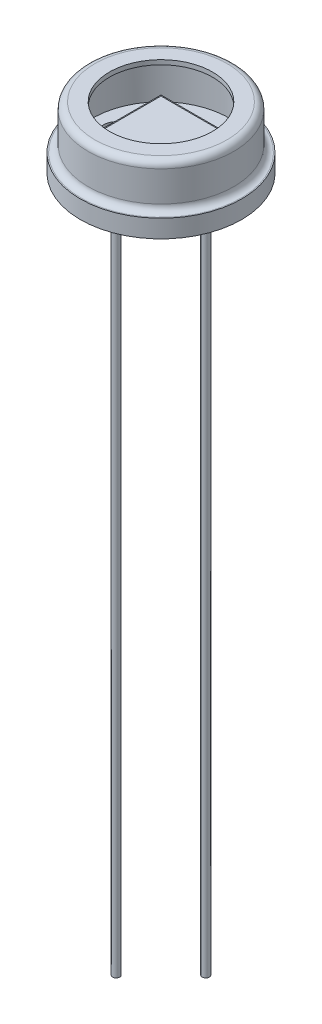
ISO-10303-21;
HEADER;
FILE_DESCRIPTION(('STEP AP214'),'2;1');
FILE_NAME('part.step','',(''),(''),'','','');
FILE_SCHEMA(('AUTOMOTIVE_DESIGN { 1 0 10303 214 1 1 1 1 }'));
ENDSEC;
DATA;
#1=APPLICATION_CONTEXT('core data for automotive mechanical design processes');
#2=APPLICATION_PROTOCOL_DEFINITION('international standard','automotive_design',2000,#1);
#3=PRODUCT_CONTEXT('',#1,'mechanical');
#4=PRODUCT('Part','Part','',(#3));
#5=PRODUCT_RELATED_PRODUCT_CATEGORY('part','',(#4));
#6=PRODUCT_DEFINITION_FORMATION('','',#4);
#7=PRODUCT_DEFINITION_CONTEXT('part definition',#1,'design');
#8=PRODUCT_DEFINITION('design','',#6,#7);
#9=PRODUCT_DEFINITION_SHAPE('','',#8);
#10=(LENGTH_UNIT() NAMED_UNIT(*) SI_UNIT(.MILLI.,.METRE.));
#11=(NAMED_UNIT(*) PLANE_ANGLE_UNIT() SI_UNIT($,.RADIAN.));
#12=(NAMED_UNIT(*) SI_UNIT($,.STERADIAN.) SOLID_ANGLE_UNIT());
#13=UNCERTAINTY_MEASURE_WITH_UNIT(LENGTH_MEASURE(1.E-05),#10,'distance_accuracy_value','');
#14=(GEOMETRIC_REPRESENTATION_CONTEXT(3) GLOBAL_UNCERTAINTY_ASSIGNED_CONTEXT((#13)) GLOBAL_UNIT_ASSIGNED_CONTEXT((#10,
#11,#12)) REPRESENTATION_CONTEXT('',''));
#15=CARTESIAN_POINT('',(0.,0.,0.));
#16=DIRECTION('',(0.,0.,1.));
#17=DIRECTION('',(1.,0.,0.));
#18=AXIS2_PLACEMENT_3D('',#15,#16,#17);
#19=CARTESIAN_POINT('',(0.,1.016,0.));
#20=DIRECTION('',(0.,-1.,0.));
#21=DIRECTION('',(0.,0.,-1.));
#22=AXIS2_PLACEMENT_3D('',#19,#20,#21);
#23=CYLINDRICAL_SURFACE('',#22,4.572);
#24=CARTESIAN_POINT('',(0.,1.016,0.));
#25=DIRECTION('',(0.,1.,0.));
#26=DIRECTION('',(0.,0.,1.));
#27=AXIS2_PLACEMENT_3D('',#24,#25,#26);
#28=CIRCLE('',#27,4.572);
#29=CARTESIAN_POINT('',(0.,1.016,4.572));
#30=VERTEX_POINT('',#29);
#31=EDGE_CURVE('E247',#30,#30,#28,.T.);
#32=ORIENTED_EDGE('',*,*,#31,.F.);
#33=EDGE_LOOP('',(#32));
#34=FACE_BOUND('',#33,.T.);
#35=CARTESIAN_POINT('',(0.,0.,0.));
#36=DIRECTION('',(0.,1.,0.));
#37=DIRECTION('',(0.,0.,1.));
#38=AXIS2_PLACEMENT_3D('',#35,#36,#37);
#39=CIRCLE('',#38,4.572);
#40=CARTESIAN_POINT('',(-3.56344654667089,0.,-2.86444282697687));
#41=VERTEX_POINT('',#40);
#42=CARTESIAN_POINT('',(-2.86444282697686,0.,-3.56344654667091));
#43=VERTEX_POINT('',#42);
#44=EDGE_CURVE('E246',#41,#43,#39,.T.);
#45=ORIENTED_EDGE('',*,*,#44,.T.);
#46=DIRECTION('',(0.,-1.,0.));
#47=VECTOR('',#46,1.);
#48=CARTESIAN_POINT('',(-2.86444282697686,1.016,-3.5634465466709));
#49=LINE('',#48,#47);
#50=CARTESIAN_POINT('',(-2.86444282697686,0.762,-3.5634465466709));
#51=VERTEX_POINT('',#50);
#52=EDGE_CURVE('E278',#43,#51,#49,.F.);
#53=ORIENTED_EDGE('',*,*,#52,.T.);
#54=CARTESIAN_POINT('',(0.,0.762,0.));
#55=DIRECTION('',(0.,-1.,0.));
#56=DIRECTION('',(0.,0.,1.));
#57=AXIS2_PLACEMENT_3D('',#54,#55,#56);
#58=CIRCLE('',#57,4.572);
#59=CARTESIAN_POINT('',(-3.56344654667089,0.762,-2.86444282697687));
#60=VERTEX_POINT('',#59);
#61=EDGE_CURVE('E332',#60,#51,#58,.T.);
#62=ORIENTED_EDGE('',*,*,#61,.F.);
#63=DIRECTION('',(0.,-1.,0.));
#64=VECTOR('',#63,1.);
#65=CARTESIAN_POINT('',(-3.56344654667089,1.016,-2.86444282697687));
#66=LINE('',#65,#64);
#67=EDGE_CURVE('E275',#60,#41,#66,.T.);
#68=ORIENTED_EDGE('',*,*,#67,.T.);
#69=EDGE_LOOP('',(#45,#53,#62,#68));
#70=FACE_BOUND('',#69,.T.);
#71=ADVANCED_FACE('F32',(#34,#70),#23,.T.);
#72=CARTESIAN_POINT('',(0.,1.9304,0.));
#73=DIRECTION('',(0.,1.,0.));
#74=DIRECTION('',(0.,0.,1.));
#75=AXIS2_PLACEMENT_3D('',#72,#73,#74);
#76=PLANE('',#75);
#77=DIRECTION('',(0.,0.,1.));
#78=VECTOR('',#77,1.);
#79=CARTESIAN_POINT('',(-1.905,1.9304,1.905));
#80=LINE('',#79,#78);
#81=CARTESIAN_POINT('',(-1.905,1.9304,-1.905));
#82=VERTEX_POINT('',#81);
#83=CARTESIAN_POINT('',(-1.905,1.9304,1.905));
#84=VERTEX_POINT('',#83);
#85=EDGE_CURVE('E193',#82,#84,#80,.T.);
#86=ORIENTED_EDGE('',*,*,#85,.T.);
#87=DIRECTION('',(1.,0.,0.));
#88=VECTOR('',#87,1.);
#89=CARTESIAN_POINT('',(1.905,1.9304,1.905));
#90=LINE('',#89,#88);
#91=CARTESIAN_POINT('',(1.905,1.9304,1.905));
#92=VERTEX_POINT('',#91);
#93=EDGE_CURVE('E196',#84,#92,#90,.T.);
#94=ORIENTED_EDGE('',*,*,#93,.T.);
#95=DIRECTION('',(0.,0.,-1.));
#96=VECTOR('',#95,1.);
#97=CARTESIAN_POINT('',(1.905,1.9304,1.905));
#98=LINE('',#97,#96);
#99=CARTESIAN_POINT('',(1.905,1.9304,-1.905));
#100=VERTEX_POINT('',#99);
#101=EDGE_CURVE('E199',#92,#100,#98,.T.);
#102=ORIENTED_EDGE('',*,*,#101,.T.);
#103=DIRECTION('',(-1.,0.,0.));
#104=VECTOR('',#103,1.);
#105=CARTESIAN_POINT('',(1.905,1.9304,-1.905));
#106=LINE('',#105,#104);
#107=EDGE_CURVE('E201',#100,#82,#106,.T.);
#108=ORIENTED_EDGE('',*,*,#107,.T.);
#109=EDGE_LOOP('',(#86,#94,#102,#108));
#110=FACE_BOUND('',#109,.T.);
#111=DIRECTION('',(-1.,0.,0.));
#112=VECTOR('',#111,1.);
#113=CARTESIAN_POINT('',(1.7999964,1.9304,-1.7999964));
#114=LINE('',#113,#112);
#115=CARTESIAN_POINT('',(1.7999964,1.9304,-1.7999964));
#116=VERTEX_POINT('',#115);
#117=CARTESIAN_POINT('',(-1.7999964,1.9304,-1.7999964));
#118=VERTEX_POINT('',#117);
#119=EDGE_CURVE('E352',#116,#118,#114,.T.);
#120=ORIENTED_EDGE('',*,*,#119,.F.);
#121=DIRECTION('',(0.,0.,-1.));
#122=VECTOR('',#121,1.);
#123=CARTESIAN_POINT('',(1.7999964,1.9304,-1.7999964));
#124=LINE('',#123,#122);
#125=CARTESIAN_POINT('',(1.7999964,1.9304,1.7999964));
#126=VERTEX_POINT('',#125);
#127=EDGE_CURVE('E182',#126,#116,#124,.T.);
#128=ORIENTED_EDGE('',*,*,#127,.F.);
#129=DIRECTION('',(1.,0.,0.));
#130=VECTOR('',#129,1.);
#131=CARTESIAN_POINT('',(1.7999964,1.9304,1.7999964));
#132=LINE('',#131,#130);
#133=CARTESIAN_POINT('',(-1.7999964,1.9304,1.7999964));
#134=VERTEX_POINT('',#133);
#135=EDGE_CURVE('E178',#134,#126,#132,.T.);
#136=ORIENTED_EDGE('',*,*,#135,.F.);
#137=DIRECTION('',(0.,0.,1.));
#138=VECTOR('',#137,1.);
#139=CARTESIAN_POINT('',(-1.7999964,1.9304,-1.7999964));
#140=LINE('',#139,#138);
#141=EDGE_CURVE('E354',#118,#134,#140,.T.);
#142=ORIENTED_EDGE('',*,*,#141,.F.);
#143=EDGE_LOOP('',(#120,#128,#136,#142));
#144=FACE_BOUND('',#143,.T.);
#145=ADVANCED_FACE('F366',(#110,#144),#76,.T.);
#146=CARTESIAN_POINT('',(0.,0.762,0.));
#147=DIRECTION('',(0.,1.,0.));
#148=DIRECTION('',(0.,0.,1.));
#149=AXIS2_PLACEMENT_3D('',#146,#147,#148);
#150=PLANE('',#149);
#151=CARTESIAN_POINT('',(0.,0.762,0.));
#152=DIRECTION('',(0.,1.,0.));
#153=DIRECTION('',(0.,0.,1.));
#154=AXIS2_PLACEMENT_3D('',#151,#152,#153);
#155=CIRCLE('',#154,3.8735);
#156=CARTESIAN_POINT('',(0.,0.762,3.8735));
#157=VERTEX_POINT('',#156);
#158=EDGE_CURVE('E243',#157,#157,#155,.T.);
#159=ORIENTED_EDGE('',*,*,#158,.T.);
#160=EDGE_LOOP('',(#159));
#161=FACE_BOUND('',#160,.T.);
#162=DIRECTION('',(1.,0.,0.));
#163=VECTOR('',#162,1.);
#164=CARTESIAN_POINT('',(1.905,0.762,1.905));
#165=LINE('',#164,#163);
#166=CARTESIAN_POINT('',(-1.905,0.762,1.905));
#167=VERTEX_POINT('',#166);
#168=CARTESIAN_POINT('',(1.905,0.762,1.905));
#169=VERTEX_POINT('',#168);
#170=EDGE_CURVE('E204',#167,#169,#165,.T.);
#171=ORIENTED_EDGE('',*,*,#170,.F.);
#172=DIRECTION('',(0.,0.,1.));
#173=VECTOR('',#172,1.);
#174=CARTESIAN_POINT('',(-1.905,0.762,1.905));
#175=LINE('',#174,#173);
#176=CARTESIAN_POINT('',(-1.905,0.762,0.290993556629694));
#177=VERTEX_POINT('',#176);
#178=EDGE_CURVE('E184',#177,#167,#175,.T.);
#179=ORIENTED_EDGE('',*,*,#178,.F.);
#180=CARTESIAN_POINT('',(-2.54,0.762,0.));
#181=DIRECTION('',(0.,1.,0.));
#182=DIRECTION('',(0.,0.,1.));
#183=AXIS2_PLACEMENT_3D('',#180,#181,#182);
#184=CIRCLE('',#183,0.6985);
#185=CARTESIAN_POINT('',(-1.905,0.762,-0.290993556629693));
#186=VERTEX_POINT('',#185);
#187=EDGE_CURVE('E223',#186,#177,#184,.T.);
#188=ORIENTED_EDGE('',*,*,#187,.F.);
#189=CARTESIAN_POINT('',(-1.905,0.762,-1.905));
#190=VERTEX_POINT('',#189);
#191=EDGE_CURVE('E188',#190,#186,#175,.T.);
#192=ORIENTED_EDGE('',*,*,#191,.F.);
#193=DIRECTION('',(-1.,0.,0.));
#194=VECTOR('',#193,1.);
#195=CARTESIAN_POINT('',(1.905,0.762,-1.905));
#196=LINE('',#195,#194);
#197=CARTESIAN_POINT('',(1.905,0.762,-1.905));
#198=VERTEX_POINT('',#197);
#199=EDGE_CURVE('E197',#198,#190,#196,.T.);
#200=ORIENTED_EDGE('',*,*,#199,.F.);
#201=DIRECTION('',(0.,0.,-1.));
#202=VECTOR('',#201,1.);
#203=CARTESIAN_POINT('',(1.905,0.762,1.905));
#204=LINE('',#203,#202);
#205=CARTESIAN_POINT('',(1.905,0.762,-0.290993556629697));
#206=VERTEX_POINT('',#205);
#207=EDGE_CURVE('E206',#206,#198,#204,.T.);
#208=ORIENTED_EDGE('',*,*,#207,.F.);
#209=CARTESIAN_POINT('',(2.54,0.762,0.));
#210=DIRECTION('',(0.,1.,0.));
#211=DIRECTION('',(0.,0.,1.));
#212=AXIS2_PLACEMENT_3D('',#209,#210,#211);
#213=CIRCLE('',#212,0.6985);
#214=CARTESIAN_POINT('',(1.905,0.762,0.290993556629697));
#215=VERTEX_POINT('',#214);
#216=EDGE_CURVE('E227',#215,#206,#213,.T.);
#217=ORIENTED_EDGE('',*,*,#216,.F.);
#218=EDGE_CURVE('E207',#169,#215,#204,.T.);
#219=ORIENTED_EDGE('',*,*,#218,.F.);
#220=EDGE_LOOP('',(#171,#179,#188,#192,#200,#208,#217,#219));
#221=FACE_BOUND('',#220,.T.);
#222=ADVANCED_FACE('F368',(#161,#221),#150,.T.);
#223=CARTESIAN_POINT('',(0.,3.2512,0.));
#224=DIRECTION('',(0.,1.,0.));
#225=DIRECTION('',(0.,0.,1.));
#226=AXIS2_PLACEMENT_3D('',#223,#224,#225);
#227=PLANE('',#226);
#228=CARTESIAN_POINT('',(0.,3.2512,0.));
#229=DIRECTION('',(0.,1.,0.));
#230=DIRECTION('',(0.,0.,1.));
#231=AXIS2_PLACEMENT_3D('',#228,#229,#230);
#232=CIRCLE('',#231,2.921);
#233=CARTESIAN_POINT('',(0.,3.2512,2.921));
#234=VERTEX_POINT('',#233);
#235=EDGE_CURVE('E234',#234,#234,#232,.F.);
#236=ORIENTED_EDGE('',*,*,#235,.F.);
#237=EDGE_LOOP('',(#236));
#238=FACE_BOUND('',#237,.T.);
#239=CARTESIAN_POINT('',(0.,3.2512,0.));
#240=DIRECTION('',(0.,1.,0.));
#241=DIRECTION('',(0.,0.,1.));
#242=AXIS2_PLACEMENT_3D('',#239,#240,#241);
#243=CIRCLE('',#242,3.7465);
#244=CARTESIAN_POINT('',(0.,3.2512,3.7465));
#245=VERTEX_POINT('',#244);
#246=EDGE_CURVE('E250',#245,#245,#243,.T.);
#247=ORIENTED_EDGE('',*,*,#246,.F.);
#248=EDGE_LOOP('',(#247));
#249=FACE_BOUND('',#248,.T.);
#250=ADVANCED_FACE('F375',(#238,#249),#227,.F.);
#251=CARTESIAN_POINT('',(0.,3.1242,0.));
#252=DIRECTION('',(0.,1.,0.));
#253=DIRECTION('',(0.,0.,1.));
#254=AXIS2_PLACEMENT_3D('',#251,#252,#253);
#255=TOROIDAL_SURFACE('',#254,3.7465,0.127);
#256=CARTESIAN_POINT('',(0.,3.1242,0.));
#257=DIRECTION('',(0.,-1.,0.));
#258=DIRECTION('',(0.,0.,-1.));
#259=AXIS2_PLACEMENT_3D('',#256,#257,#258);
#260=CIRCLE('',#259,3.8735);
#261=CARTESIAN_POINT('',(0.,3.1242,-3.8735));
#262=VERTEX_POINT('',#261);
#263=EDGE_CURVE('E253',#262,#262,#260,.T.);
#264=ORIENTED_EDGE('',*,*,#263,.T.);
#265=EDGE_LOOP('',(#264));
#266=FACE_BOUND('',#265,.T.);
#267=ORIENTED_EDGE('',*,*,#246,.T.);
#268=EDGE_LOOP('',(#267));
#269=FACE_BOUND('',#268,.T.);
#270=ADVANCED_FACE('F435',(#266,#269),#255,.F.);
#271=CARTESIAN_POINT('',(0.,3.5052,0.));
#272=DIRECTION('',(0.,-1.,0.));
#273=DIRECTION('',(0.,0.,-1.));
#274=AXIS2_PLACEMENT_3D('',#271,#272,#273);
#275=CYLINDRICAL_SURFACE('',#274,3.8735);
#276=ORIENTED_EDGE('',*,*,#263,.F.);
#277=EDGE_LOOP('',(#276));
#278=FACE_BOUND('',#277,.T.);
#279=ORIENTED_EDGE('',*,*,#158,.F.);
#280=EDGE_LOOP('',(#279));
#281=FACE_BOUND('',#280,.T.);
#282=ADVANCED_FACE('F424',(#278,#281),#275,.F.);
#283=CARTESIAN_POINT('',(0.,-0.00100000000000013,0.));
#284=DIRECTION('',(0.,1.,0.));
#285=DIRECTION('',(0.,0.,1.));
#286=AXIS2_PLACEMENT_3D('',#283,#284,#285);
#287=CYLINDRICAL_SURFACE('',#286,2.921);
#288=CARTESIAN_POINT('',(0.,3.5052,0.));
#289=DIRECTION('',(0.,1.,0.));
#290=DIRECTION('',(0.,0.,1.));
#291=AXIS2_PLACEMENT_3D('',#288,#289,#290);
#292=CIRCLE('',#291,2.921);
#293=CARTESIAN_POINT('',(0.,3.5052,2.921));
#294=VERTEX_POINT('',#293);
#295=EDGE_CURVE('E240',#294,#294,#292,.T.);
#296=ORIENTED_EDGE('',*,*,#295,.T.);
#297=EDGE_LOOP('',(#296));
#298=FACE_BOUND('',#297,.T.);
#299=ORIENTED_EDGE('',*,*,#235,.T.);
#300=EDGE_LOOP('',(#299));
#301=FACE_BOUND('',#300,.T.);
#302=ADVANCED_FACE('F421',(#298,#301),#287,.F.);
#303=CARTESIAN_POINT('',(0.,3.5052,0.));
#304=DIRECTION('',(0.,-1.,0.));
#305=DIRECTION('',(0.,0.,-1.));
#306=AXIS2_PLACEMENT_3D('',#303,#304,#305);
#307=CYLINDRICAL_SURFACE('',#306,4.1275);
#308=CARTESIAN_POINT('',(0.,1.397,0.));
#309=DIRECTION('',(0.,1.,0.));
#310=DIRECTION('',(0.,0.,1.));
#311=AXIS2_PLACEMENT_3D('',#308,#309,#310);
#312=CIRCLE('',#311,4.1275);
#313=CARTESIAN_POINT('',(0.,1.397,4.1275));
#314=VERTEX_POINT('',#313);
#315=EDGE_CURVE('E264',#314,#314,#312,.T.);
#316=ORIENTED_EDGE('',*,*,#315,.T.);
#317=EDGE_LOOP('',(#316));
#318=FACE_BOUND('',#317,.T.);
#319=CARTESIAN_POINT('',(0.,3.1242,0.));
#320=DIRECTION('',(0.,1.,0.));
#321=DIRECTION('',(0.,0.,1.));
#322=AXIS2_PLACEMENT_3D('',#319,#320,#321);
#323=CIRCLE('',#322,4.1275);
#324=CARTESIAN_POINT('',(0.,3.1242,4.1275));
#325=VERTEX_POINT('',#324);
#326=EDGE_CURVE('E261',#325,#325,#323,.F.);
#327=ORIENTED_EDGE('',*,*,#326,.T.);
#328=EDGE_LOOP('',(#327));
#329=FACE_BOUND('',#328,.T.);
#330=ADVANCED_FACE('F423',(#318,#329),#307,.T.);
#331=CARTESIAN_POINT('',(0.,3.5052,0.));
#332=DIRECTION('',(0.,1.,0.));
#333=DIRECTION('',(0.,0.,1.));
#334=AXIS2_PLACEMENT_3D('',#331,#332,#333);
#335=PLANE('',#334);
#336=ORIENTED_EDGE('',*,*,#295,.F.);
#337=EDGE_LOOP('',(#336));
#338=FACE_BOUND('',#337,.T.);
#339=CARTESIAN_POINT('',(0.,3.5052,0.));
#340=DIRECTION('',(0.,1.,0.));
#341=DIRECTION('',(0.,0.,1.));
#342=AXIS2_PLACEMENT_3D('',#339,#340,#341);
#343=CIRCLE('',#342,3.7465);
#344=CARTESIAN_POINT('',(0.,3.5052,3.7465));
#345=VERTEX_POINT('',#344);
#346=EDGE_CURVE('E256',#345,#345,#343,.T.);
#347=ORIENTED_EDGE('',*,*,#346,.T.);
#348=EDGE_LOOP('',(#347));
#349=FACE_BOUND('',#348,.T.);
#350=ADVANCED_FACE('F445',(#338,#349),#335,.T.);
#351=CARTESIAN_POINT('',(0.,3.1242,0.));
#352=DIRECTION('',(0.,1.,0.));
#353=DIRECTION('',(0.,0.,1.));
#354=AXIS2_PLACEMENT_3D('',#351,#352,#353);
#355=TOROIDAL_SURFACE('',#354,3.7465,0.381);
#356=ORIENTED_EDGE('',*,*,#326,.F.);
#357=EDGE_LOOP('',(#356));
#358=FACE_BOUND('',#357,.T.);
#359=ORIENTED_EDGE('',*,*,#346,.F.);
#360=EDGE_LOOP('',(#359));
#361=FACE_BOUND('',#360,.T.);
#362=ADVANCED_FACE('F430',(#358,#361),#355,.T.);
#363=CARTESIAN_POINT('',(0.,1.016,0.));
#364=DIRECTION('',(0.,1.,0.));
#365=DIRECTION('',(0.,0.,1.));
#366=AXIS2_PLACEMENT_3D('',#363,#364,#365);
#367=PLANE('',#366);
#368=CARTESIAN_POINT('',(0.,1.016,0.));
#369=DIRECTION('',(0.,1.,0.));
#370=DIRECTION('',(0.,0.,1.));
#371=AXIS2_PLACEMENT_3D('',#368,#369,#370);
#372=CIRCLE('',#371,4.5085);
#373=CARTESIAN_POINT('',(0.,1.016,4.5085));
#374=VERTEX_POINT('',#373);
#375=EDGE_CURVE('E267',#374,#374,#372,.F.);
#376=ORIENTED_EDGE('',*,*,#375,.T.);
#377=EDGE_LOOP('',(#376));
#378=FACE_BOUND('',#377,.T.);
#379=ORIENTED_EDGE('',*,*,#31,.T.);
#380=EDGE_LOOP('',(#379));
#381=FACE_BOUND('',#380,.T.);
#382=ADVANCED_FACE('F427',(#378,#381),#367,.T.);
#383=CARTESIAN_POINT('',(0.,0.,0.));
#384=DIRECTION('',(0.,1.,0.));
#385=DIRECTION('',(0.,0.,1.));
#386=AXIS2_PLACEMENT_3D('',#383,#384,#385);
#387=PLANE('',#386);
#388=CARTESIAN_POINT('',(-2.54,0.,0.));
#389=DIRECTION('',(0.,1.,0.));
#390=DIRECTION('',(0.,0.,1.));
#391=AXIS2_PLACEMENT_3D('',#388,#389,#390);
#392=CIRCLE('',#391,0.2032);
#393=CARTESIAN_POINT('',(-2.54,0.,0.2032));
#394=VERTEX_POINT('',#393);
#395=EDGE_CURVE('E317',#394,#394,#392,.T.);
#396=ORIENTED_EDGE('',*,*,#395,.T.);
#397=EDGE_LOOP('',(#396));
#398=FACE_BOUND('',#397,.T.);
#399=CARTESIAN_POINT('',(0.,0.,2.54));
#400=DIRECTION('',(0.,1.,0.));
#401=DIRECTION('',(0.,0.,1.));
#402=AXIS2_PLACEMENT_3D('',#399,#400,#401);
#403=CIRCLE('',#402,0.2032);
#404=CARTESIAN_POINT('',(0.,0.,2.7432));
#405=VERTEX_POINT('',#404);
#406=EDGE_CURVE('E307',#405,#405,#403,.T.);
#407=ORIENTED_EDGE('',*,*,#406,.T.);
#408=EDGE_LOOP('',(#407));
#409=FACE_BOUND('',#408,.T.);
#410=CARTESIAN_POINT('',(2.54,0.,0.));
#411=DIRECTION('',(0.,1.,0.));
#412=DIRECTION('',(0.,0.,1.));
#413=AXIS2_PLACEMENT_3D('',#410,#411,#412);
#414=CIRCLE('',#413,0.2032);
#415=CARTESIAN_POINT('',(2.54,0.,0.2032));
#416=VERTEX_POINT('',#415);
#417=EDGE_CURVE('E328',#416,#416,#414,.T.);
#418=ORIENTED_EDGE('',*,*,#417,.T.);
#419=EDGE_LOOP('',(#418));
#420=FACE_BOUND('',#419,.T.);
#421=DIRECTION('',(-0.707106781186549,0.,0.707106781186546));
#422=VECTOR('',#421,1.);
#423=CARTESIAN_POINT('',(-4.2207203769025,0.,-3.68190500963836));
#424=LINE('',#423,#422);
#425=CARTESIAN_POINT('',(-3.77170757084904,0.,-4.13091781569182));
#426=VERTEX_POINT('',#425);
#427=CARTESIAN_POINT('',(-4.1309178156918,0.,-3.77170757084905));
#428=VERTEX_POINT('',#427);
#429=EDGE_CURVE('E344',#426,#428,#424,.T.);
#430=ORIENTED_EDGE('',*,*,#429,.F.);
#431=CARTESIAN_POINT('',(-3.68190500963835,0.,-4.04111525448113));
#432=DIRECTION('',(0.,1.,0.));
#433=DIRECTION('',(0.,0.,1.));
#434=AXIS2_PLACEMENT_3D('',#431,#432,#433);
#435=CIRCLE('',#434,0.127);
#436=CARTESIAN_POINT('',(-3.59210244842766,0.,-4.13091781569182));
#437=VERTEX_POINT('',#436);
#438=EDGE_CURVE('E288',#426,#437,#435,.F.);
#439=ORIENTED_EDGE('',*,*,#438,.T.);
#440=DIRECTION('',(-0.707106781186546,0.,-0.707106781186549));
#441=VECTOR('',#440,1.);
#442=CARTESIAN_POINT('',(-3.68190500963835,0.,-4.22072037690251));
#443=LINE('',#442,#441);
#444=CARTESIAN_POINT('',(-3.03381324449247,0.,-3.57262861175663));
#445=VERTEX_POINT('',#444);
#446=EDGE_CURVE('E331',#445,#437,#443,.T.);
#447=ORIENTED_EDGE('',*,*,#446,.F.);
#448=CARTESIAN_POINT('',(-2.94401068328177,0.,-3.66243117296732));
#449=DIRECTION('',(0.,1.,0.));
#450=DIRECTION('',(0.,0.,1.));
#451=AXIS2_PLACEMENT_3D('',#448,#449,#450);
#452=CIRCLE('',#451,0.127);
#453=EDGE_CURVE('E297',#445,#43,#452,.T.);
#454=ORIENTED_EDGE('',*,*,#453,.T.);
#455=ORIENTED_EDGE('',*,*,#44,.F.);
#456=CARTESIAN_POINT('',(-3.66243117296731,0.,-2.94401068328179));
#457=DIRECTION('',(0.,1.,0.));
#458=DIRECTION('',(0.,0.,1.));
#459=AXIS2_PLACEMENT_3D('',#456,#457,#458);
#460=CIRCLE('',#459,0.127);
#461=CARTESIAN_POINT('',(-3.57262861175662,0.,-3.03381324449248));
#462=VERTEX_POINT('',#461);
#463=EDGE_CURVE('E301',#41,#462,#460,.T.);
#464=ORIENTED_EDGE('',*,*,#463,.T.);
#465=DIRECTION('',(0.707106781186546,0.,0.707106781186549));
#466=VECTOR('',#465,1.);
#467=CARTESIAN_POINT('',(-3.49105501069939,0.,-2.95223964343525));
#468=LINE('',#467,#466);
#469=CARTESIAN_POINT('',(-4.1309178156918,0.,-3.59210244842767));
#470=VERTEX_POINT('',#469);
#471=EDGE_CURVE('E335',#470,#462,#468,.T.);
#472=ORIENTED_EDGE('',*,*,#471,.F.);
#473=CARTESIAN_POINT('',(-4.04111525448111,0.,-3.68190500963836));
#474=DIRECTION('',(0.,1.,0.));
#475=DIRECTION('',(0.,0.,1.));
#476=AXIS2_PLACEMENT_3D('',#473,#474,#475);
#477=CIRCLE('',#476,0.127);
#478=EDGE_CURVE('E286',#470,#428,#477,.F.);
#479=ORIENTED_EDGE('',*,*,#478,.T.);
#480=EDGE_LOOP('',(#430,#439,#447,#454,#455,#464,#472,#479));
#481=FACE_BOUND('',#480,.T.);
#482=ADVANCED_FACE('F429',(#398,#409,#420,#481),#387,.F.);
#483=CARTESIAN_POINT('',(0.,1.397,0.));
#484=DIRECTION('',(0.,1.,0.));
#485=DIRECTION('',(0.,0.,1.));
#486=AXIS2_PLACEMENT_3D('',#483,#484,#485);
#487=TOROIDAL_SURFACE('',#486,4.5085,0.381);
#488=ORIENTED_EDGE('',*,*,#375,.F.);
#489=EDGE_LOOP('',(#488));
#490=FACE_BOUND('',#489,.T.);
#491=ORIENTED_EDGE('',*,*,#315,.F.);
#492=EDGE_LOOP('',(#491));
#493=FACE_BOUND('',#492,.T.);
#494=ADVANCED_FACE('F419',(#490,#493),#487,.F.);
#495=CARTESIAN_POINT('',(2.54,0.508,0.));
#496=DIRECTION('',(0.,1.,0.));
#497=DIRECTION('',(0.,0.,1.));
#498=AXIS2_PLACEMENT_3D('',#495,#496,#497);
#499=CYLINDRICAL_SURFACE('',#498,0.6985);
#500=CARTESIAN_POINT('',(2.54,0.508,0.));
#501=DIRECTION('',(0.,1.,0.));
#502=DIRECTION('',(0.,0.,1.));
#503=AXIS2_PLACEMENT_3D('',#500,#501,#502);
#504=CIRCLE('',#503,0.6985);
#505=CARTESIAN_POINT('',(2.54,0.508,0.6985));
#506=VERTEX_POINT('',#505);
#507=EDGE_CURVE('E231',#506,#506,#504,.T.);
#508=ORIENTED_EDGE('',*,*,#507,.F.);
#509=EDGE_LOOP('',(#508));
#510=FACE_BOUND('',#509,.T.);
#511=EDGE_CURVE('E235',#206,#215,#213,.T.);
#512=ORIENTED_EDGE('',*,*,#511,.T.);
#513=ORIENTED_EDGE('',*,*,#216,.T.);
#514=EDGE_LOOP('',(#512,#513));
#515=FACE_BOUND('',#514,.T.);
#516=ADVANCED_FACE('F415',(#510,#515),#499,.F.);
#517=CARTESIAN_POINT('',(2.54,0.508,0.));
#518=DIRECTION('',(0.,1.,0.));
#519=DIRECTION('',(0.,0.,1.));
#520=AXIS2_PLACEMENT_3D('',#517,#518,#519);
#521=PLANE('',#520);
#522=CARTESIAN_POINT('',(2.54,0.508,0.));
#523=DIRECTION('',(0.,1.,0.));
#524=DIRECTION('',(0.,0.,1.));
#525=AXIS2_PLACEMENT_3D('',#522,#523,#524);
#526=CIRCLE('',#525,0.2032);
#527=CARTESIAN_POINT('',(2.54,0.508,0.2032));
#528=VERTEX_POINT('',#527);
#529=EDGE_CURVE('E40',#528,#528,#526,.T.);
#530=ORIENTED_EDGE('',*,*,#529,.F.);
#531=EDGE_LOOP('',(#530));
#532=FACE_BOUND('',#531,.T.);
#533=ORIENTED_EDGE('',*,*,#507,.T.);
#534=EDGE_LOOP('',(#533));
#535=FACE_BOUND('',#534,.T.);
#536=ADVANCED_FACE('F411',(#532,#535),#521,.T.);
#537=CARTESIAN_POINT('',(-2.54,0.508,0.));
#538=DIRECTION('',(0.,1.,0.));
#539=DIRECTION('',(0.,0.,1.));
#540=AXIS2_PLACEMENT_3D('',#537,#538,#539);
#541=CYLINDRICAL_SURFACE('',#540,0.6985);
#542=CARTESIAN_POINT('',(-2.54,0.508,0.));
#543=DIRECTION('',(0.,1.,0.));
#544=DIRECTION('',(0.,0.,1.));
#545=AXIS2_PLACEMENT_3D('',#542,#543,#544);
#546=CIRCLE('',#545,0.6985);
#547=CARTESIAN_POINT('',(-2.54,0.508,0.698500000000001));
#548=VERTEX_POINT('',#547);
#549=EDGE_CURVE('E224',#548,#548,#546,.T.);
#550=ORIENTED_EDGE('',*,*,#549,.F.);
#551=EDGE_LOOP('',(#550));
#552=FACE_BOUND('',#551,.T.);
#553=EDGE_CURVE('E228',#177,#186,#184,.T.);
#554=ORIENTED_EDGE('',*,*,#553,.T.);
#555=ORIENTED_EDGE('',*,*,#187,.T.);
#556=EDGE_LOOP('',(#554,#555));
#557=FACE_BOUND('',#556,.T.);
#558=ADVANCED_FACE('F407',(#552,#557),#541,.F.);
#559=CARTESIAN_POINT('',(-2.54,0.508,0.));
#560=DIRECTION('',(0.,1.,0.));
#561=DIRECTION('',(0.,0.,1.));
#562=AXIS2_PLACEMENT_3D('',#559,#560,#561);
#563=PLANE('',#562);
#564=CARTESIAN_POINT('',(-2.54,0.508,0.));
#565=DIRECTION('',(0.,1.,0.));
#566=DIRECTION('',(0.,0.,1.));
#567=AXIS2_PLACEMENT_3D('',#564,#565,#566);
#568=CIRCLE('',#567,0.2032);
#569=CARTESIAN_POINT('',(-2.54,0.508,0.2032));
#570=VERTEX_POINT('',#569);
#571=EDGE_CURVE('E11',#570,#570,#568,.T.);
#572=ORIENTED_EDGE('',*,*,#571,.F.);
#573=EDGE_LOOP('',(#572));
#574=FACE_BOUND('',#573,.T.);
#575=ORIENTED_EDGE('',*,*,#549,.T.);
#576=EDGE_LOOP('',(#575));
#577=FACE_BOUND('',#576,.T.);
#578=ADVANCED_FACE('F387',(#574,#577),#563,.T.);
#579=CARTESIAN_POINT('',(0.,0.762,0.));
#580=DIRECTION('',(0.,1.,0.));
#581=DIRECTION('',(0.,0.,1.));
#582=AXIS2_PLACEMENT_3D('',#579,#580,#581);
#583=PLANE('',#582);
#584=EDGE_CURVE('E210',#215,#206,#204,.T.);
#585=ORIENTED_EDGE('',*,*,#584,.F.);
#586=ORIENTED_EDGE('',*,*,#511,.F.);
#587=EDGE_LOOP('',(#585,#586));
#588=FACE_BOUND('',#587,.T.);
#589=ADVANCED_FACE('F383',(#588),#583,.F.);
#590=EDGE_CURVE('E186',#186,#177,#175,.T.);
#591=ORIENTED_EDGE('',*,*,#590,.F.);
#592=ORIENTED_EDGE('',*,*,#553,.F.);
#593=EDGE_LOOP('',(#591,#592));
#594=FACE_BOUND('',#593,.T.);
#595=ADVANCED_FACE('F386',(#594),#583,.F.);
#596=CARTESIAN_POINT('',(-1.905,1.9304,1.905));
#597=DIRECTION('',(1.,0.,0.));
#598=DIRECTION('',(0.,0.,-1.));
#599=AXIS2_PLACEMENT_3D('',#596,#597,#598);
#600=PLANE('',#599);
#601=ORIENTED_EDGE('',*,*,#191,.T.);
#602=ORIENTED_EDGE('',*,*,#590,.T.);
#603=ORIENTED_EDGE('',*,*,#178,.T.);
#604=DIRECTION('',(0.,-1.,0.));
#605=VECTOR('',#604,1.);
#606=CARTESIAN_POINT('',(-1.905,1.9304,1.905));
#607=LINE('',#606,#605);
#608=EDGE_CURVE('E220',#84,#167,#607,.T.);
#609=ORIENTED_EDGE('',*,*,#608,.F.);
#610=ORIENTED_EDGE('',*,*,#85,.F.);
#611=DIRECTION('',(0.,-1.,0.));
#612=VECTOR('',#611,1.);
#613=CARTESIAN_POINT('',(-1.905,1.9304,-1.905));
#614=LINE('',#613,#612);
#615=EDGE_CURVE('E202',#82,#190,#614,.T.);
#616=ORIENTED_EDGE('',*,*,#615,.T.);
#617=EDGE_LOOP('',(#601,#602,#603,#609,#610,#616));
#618=FACE_BOUND('',#617,.T.);
#619=ADVANCED_FACE('F400',(#618),#600,.F.);
#620=CARTESIAN_POINT('',(1.905,1.9304,1.905));
#621=DIRECTION('',(0.,0.,-1.));
#622=DIRECTION('',(-1.,0.,0.));
#623=AXIS2_PLACEMENT_3D('',#620,#621,#622);
#624=PLANE('',#623);
#625=ORIENTED_EDGE('',*,*,#170,.T.);
#626=DIRECTION('',(0.,-1.,0.));
#627=VECTOR('',#626,1.);
#628=CARTESIAN_POINT('',(1.905,1.9304,1.905));
#629=LINE('',#628,#627);
#630=EDGE_CURVE('E217',#92,#169,#629,.T.);
#631=ORIENTED_EDGE('',*,*,#630,.F.);
#632=ORIENTED_EDGE('',*,*,#93,.F.);
#633=ORIENTED_EDGE('',*,*,#608,.T.);
#634=EDGE_LOOP('',(#625,#631,#632,#633));
#635=FACE_BOUND('',#634,.T.);
#636=ADVANCED_FACE('F396',(#635),#624,.F.);
#637=CARTESIAN_POINT('',(1.905,1.9304,1.905));
#638=DIRECTION('',(-1.,0.,0.));
#639=DIRECTION('',(0.,0.,1.));
#640=AXIS2_PLACEMENT_3D('',#637,#638,#639);
#641=PLANE('',#640);
#642=ORIENTED_EDGE('',*,*,#218,.T.);
#643=ORIENTED_EDGE('',*,*,#584,.T.);
#644=ORIENTED_EDGE('',*,*,#207,.T.);
#645=DIRECTION('',(0.,-1.,0.));
#646=VECTOR('',#645,1.);
#647=CARTESIAN_POINT('',(1.905,1.9304,-1.905));
#648=LINE('',#647,#646);
#649=EDGE_CURVE('E214',#100,#198,#648,.T.);
#650=ORIENTED_EDGE('',*,*,#649,.F.);
#651=ORIENTED_EDGE('',*,*,#101,.F.);
#652=ORIENTED_EDGE('',*,*,#630,.T.);
#653=EDGE_LOOP('',(#642,#643,#644,#650,#651,#652));
#654=FACE_BOUND('',#653,.T.);
#655=ADVANCED_FACE('F392',(#654),#641,.F.);
#656=CARTESIAN_POINT('',(1.905,1.9304,-1.905));
#657=DIRECTION('',(0.,0.,1.));
#658=DIRECTION('',(1.,0.,0.));
#659=AXIS2_PLACEMENT_3D('',#656,#657,#658);
#660=PLANE('',#659);
#661=ORIENTED_EDGE('',*,*,#199,.T.);
#662=ORIENTED_EDGE('',*,*,#615,.F.);
#663=ORIENTED_EDGE('',*,*,#107,.F.);
#664=ORIENTED_EDGE('',*,*,#649,.T.);
#665=EDGE_LOOP('',(#661,#662,#663,#664));
#666=FACE_BOUND('',#665,.T.);
#667=ADVANCED_FACE('F389',(#666),#660,.F.);
#668=CARTESIAN_POINT('',(1.7999964,1.9812,-1.7999964));
#669=DIRECTION('',(-1.,0.,0.));
#670=DIRECTION('',(0.,0.,1.));
#671=AXIS2_PLACEMENT_3D('',#668,#669,#670);
#672=PLANE('',#671);
#673=ORIENTED_EDGE('',*,*,#127,.T.);
#674=DIRECTION('',(0.,-1.,0.));
#675=VECTOR('',#674,1.);
#676=CARTESIAN_POINT('',(1.7999964,1.9812,-1.7999964));
#677=LINE('',#676,#675);
#678=CARTESIAN_POINT('',(1.7999964,1.9812,-1.7999964));
#679=VERTEX_POINT('',#678);
#680=EDGE_CURVE('E162',#679,#116,#677,.T.);
#681=ORIENTED_EDGE('',*,*,#680,.F.);
#682=DIRECTION('',(0.,0.,-1.));
#683=VECTOR('',#682,1.);
#684=CARTESIAN_POINT('',(1.7999964,1.9812,-1.7999964));
#685=LINE('',#684,#683);
#686=CARTESIAN_POINT('',(1.7999964,1.9812,1.7999964));
#687=VERTEX_POINT('',#686);
#688=EDGE_CURVE('E169',#687,#679,#685,.T.);
#689=ORIENTED_EDGE('',*,*,#688,.F.);
#690=DIRECTION('',(0.,-1.,0.));
#691=VECTOR('',#690,1.);
#692=CARTESIAN_POINT('',(1.7999964,1.9812,1.7999964));
#693=LINE('',#692,#691);
#694=EDGE_CURVE('E350',#687,#126,#693,.T.);
#695=ORIENTED_EDGE('',*,*,#694,.T.);
#696=EDGE_LOOP('',(#673,#681,#689,#695));
#697=FACE_BOUND('',#696,.T.);
#698=ADVANCED_FACE('F180',(#697),#672,.F.);
#699=CARTESIAN_POINT('',(1.7999964,1.9812,-1.7999964));
#700=DIRECTION('',(0.,0.,1.));
#701=DIRECTION('',(1.,0.,0.));
#702=AXIS2_PLACEMENT_3D('',#699,#700,#701);
#703=PLANE('',#702);
#704=ORIENTED_EDGE('',*,*,#119,.T.);
#705=DIRECTION('',(0.,-1.,0.));
#706=VECTOR('',#705,1.);
#707=CARTESIAN_POINT('',(-1.7999964,1.9812,-1.7999964));
#708=LINE('',#707,#706);
#709=CARTESIAN_POINT('',(-1.7999964,1.9812,-1.7999964));
#710=VERTEX_POINT('',#709);
#711=EDGE_CURVE('E165',#710,#118,#708,.T.);
#712=ORIENTED_EDGE('',*,*,#711,.F.);
#713=DIRECTION('',(-1.,0.,0.));
#714=VECTOR('',#713,1.);
#715=CARTESIAN_POINT('',(1.7999964,1.9812,-1.7999964));
#716=LINE('',#715,#714);
#717=EDGE_CURVE('E158',#679,#710,#716,.T.);
#718=ORIENTED_EDGE('',*,*,#717,.F.);
#719=ORIENTED_EDGE('',*,*,#680,.T.);
#720=EDGE_LOOP('',(#704,#712,#718,#719));
#721=FACE_BOUND('',#720,.T.);
#722=ADVANCED_FACE('F160',(#721),#703,.F.);
#723=CARTESIAN_POINT('',(-1.7999964,1.9812,-1.7999964));
#724=DIRECTION('',(1.,0.,0.));
#725=DIRECTION('',(0.,0.,-1.));
#726=AXIS2_PLACEMENT_3D('',#723,#724,#725);
#727=PLANE('',#726);
#728=ORIENTED_EDGE('',*,*,#141,.T.);
#729=DIRECTION('',(0.,-1.,0.));
#730=VECTOR('',#729,1.);
#731=CARTESIAN_POINT('',(-1.7999964,1.9812,1.7999964));
#732=LINE('',#731,#730);
#733=CARTESIAN_POINT('',(-1.7999964,1.9812,1.7999964));
#734=VERTEX_POINT('',#733);
#735=EDGE_CURVE('E189',#734,#134,#732,.T.);
#736=ORIENTED_EDGE('',*,*,#735,.F.);
#737=DIRECTION('',(0.,0.,1.));
#738=VECTOR('',#737,1.);
#739=CARTESIAN_POINT('',(-1.7999964,1.9812,-1.7999964));
#740=LINE('',#739,#738);
#741=EDGE_CURVE('E168',#710,#734,#740,.T.);
#742=ORIENTED_EDGE('',*,*,#741,.F.);
#743=ORIENTED_EDGE('',*,*,#711,.T.);
#744=EDGE_LOOP('',(#728,#736,#742,#743));
#745=FACE_BOUND('',#744,.T.);
#746=ADVANCED_FACE('F364',(#745),#727,.F.);
#747=CARTESIAN_POINT('',(1.7999964,1.9812,1.7999964));
#748=DIRECTION('',(0.,0.,-1.));
#749=DIRECTION('',(-1.,0.,0.));
#750=AXIS2_PLACEMENT_3D('',#747,#748,#749);
#751=PLANE('',#750);
#752=ORIENTED_EDGE('',*,*,#135,.T.);
#753=ORIENTED_EDGE('',*,*,#694,.F.);
#754=DIRECTION('',(1.,0.,0.));
#755=VECTOR('',#754,1.);
#756=CARTESIAN_POINT('',(1.7999964,1.9812,1.7999964));
#757=LINE('',#756,#755);
#758=EDGE_CURVE('E174',#734,#687,#757,.T.);
#759=ORIENTED_EDGE('',*,*,#758,.F.);
#760=ORIENTED_EDGE('',*,*,#735,.T.);
#761=EDGE_LOOP('',(#752,#753,#759,#760));
#762=FACE_BOUND('',#761,.T.);
#763=ADVANCED_FACE('F360',(#762),#751,.F.);
#764=CARTESIAN_POINT('',(1.7999964,1.9812,-1.7999964));
#765=DIRECTION('',(0.,-1.,0.));
#766=DIRECTION('',(0.,0.,-1.));
#767=AXIS2_PLACEMENT_3D('',#764,#765,#766);
#768=PLANE('',#767);
#769=ORIENTED_EDGE('',*,*,#688,.T.);
#770=ORIENTED_EDGE('',*,*,#717,.T.);
#771=ORIENTED_EDGE('',*,*,#741,.T.);
#772=ORIENTED_EDGE('',*,*,#758,.T.);
#773=EDGE_LOOP('',(#769,#770,#771,#772));
#774=FACE_BOUND('',#773,.T.);
#775=ADVANCED_FACE('F172',(#774),#768,.F.);
#776=CARTESIAN_POINT('',(-3.68190500963835,0.762,-4.22072037690251));
#777=DIRECTION('',(-0.707106781186549,0.,0.707106781186546));
#778=DIRECTION('',(0.707106781186546,0.,0.707106781186549));
#779=AXIS2_PLACEMENT_3D('',#776,#777,#778);
#780=PLANE('',#779);
#781=DIRECTION('',(-0.707106781186546,0.,-0.707106781186549));
#782=VECTOR('',#781,1.);
#783=CARTESIAN_POINT('',(-3.68190500963835,0.762,-4.22072037690251));
#784=LINE('',#783,#782);
#785=CARTESIAN_POINT('',(-3.03381324449247,0.762,-3.57262861175663));
#786=VERTEX_POINT('',#785);
#787=CARTESIAN_POINT('',(-3.59210244842766,0.762,-4.13091781569182));
#788=VERTEX_POINT('',#787);
#789=EDGE_CURVE('E334',#786,#788,#784,.T.);
#790=ORIENTED_EDGE('',*,*,#789,.F.);
#791=DIRECTION('',(0.,1.,0.));
#792=VECTOR('',#791,1.);
#793=CARTESIAN_POINT('',(-3.03381324449247,0.,-3.57262861175663));
#794=LINE('',#793,#792);
#795=EDGE_CURVE('E272',#786,#445,#794,.F.);
#796=ORIENTED_EDGE('',*,*,#795,.T.);
#797=ORIENTED_EDGE('',*,*,#446,.T.);
#798=DIRECTION('',(0.,-1.,0.));
#799=VECTOR('',#798,1.);
#800=CARTESIAN_POINT('',(-3.59210244842766,0.762,-4.13091781569182));
#801=LINE('',#800,#799);
#802=EDGE_CURVE('E270',#437,#788,#801,.F.);
#803=ORIENTED_EDGE('',*,*,#802,.T.);
#804=EDGE_LOOP('',(#790,#796,#797,#803));
#805=FACE_BOUND('',#804,.T.);
#806=ADVANCED_FACE('F492',(#805),#780,.F.);
#807=CARTESIAN_POINT('',(-4.2207203769025,0.762,-3.68190500963836));
#808=DIRECTION('',(0.707106781186546,0.,0.707106781186549));
#809=DIRECTION('',(0.707106781186549,0.,-0.707106781186546));
#810=AXIS2_PLACEMENT_3D('',#807,#808,#809);
#811=PLANE('',#810);
#812=DIRECTION('',(-0.707106781186549,0.,0.707106781186546));
#813=VECTOR('',#812,1.);
#814=CARTESIAN_POINT('',(-4.2207203769025,0.762,-3.68190500963836));
#815=LINE('',#814,#813);
#816=CARTESIAN_POINT('',(-3.77170757084904,0.762,-4.13091781569182));
#817=VERTEX_POINT('',#816);
#818=CARTESIAN_POINT('',(-4.1309178156918,0.762,-3.77170757084905));
#819=VERTEX_POINT('',#818);
#820=EDGE_CURVE('E338',#817,#819,#815,.T.);
#821=ORIENTED_EDGE('',*,*,#820,.F.);
#822=DIRECTION('',(0.,-1.,0.));
#823=VECTOR('',#822,1.);
#824=CARTESIAN_POINT('',(-3.77170757084904,0.762,-4.13091781569182));
#825=LINE('',#824,#823);
#826=EDGE_CURVE('E283',#817,#426,#825,.T.);
#827=ORIENTED_EDGE('',*,*,#826,.T.);
#828=ORIENTED_EDGE('',*,*,#429,.T.);
#829=DIRECTION('',(0.,-1.,0.));
#830=VECTOR('',#829,1.);
#831=CARTESIAN_POINT('',(-4.1309178156918,0.762,-3.77170757084905));
#832=LINE('',#831,#830);
#833=EDGE_CURVE('E281',#428,#819,#832,.F.);
#834=ORIENTED_EDGE('',*,*,#833,.T.);
#835=EDGE_LOOP('',(#821,#827,#828,#834));
#836=FACE_BOUND('',#835,.T.);
#837=ADVANCED_FACE('F485',(#836),#811,.F.);
#838=CARTESIAN_POINT('',(-3.49105501069939,0.762,-2.95223964343525));
#839=DIRECTION('',(0.707106781186549,0.,-0.707106781186546));
#840=DIRECTION('',(-0.707106781186546,0.,-0.707106781186549));
#841=AXIS2_PLACEMENT_3D('',#838,#839,#840);
#842=PLANE('',#841);
#843=ORIENTED_EDGE('',*,*,#471,.T.);
#844=DIRECTION('',(0.,1.,0.));
#845=VECTOR('',#844,1.);
#846=CARTESIAN_POINT('',(-3.57262861175662,0.762,-3.03381324449248));
#847=LINE('',#846,#845);
#848=CARTESIAN_POINT('',(-3.57262861175662,0.762,-3.03381324449248));
#849=VERTEX_POINT('',#848);
#850=EDGE_CURVE('E47',#462,#849,#847,.T.);
#851=ORIENTED_EDGE('',*,*,#850,.T.);
#852=DIRECTION('',(0.707106781186546,0.,0.707106781186549));
#853=VECTOR('',#852,1.);
#854=CARTESIAN_POINT('',(-3.49105501069939,0.762,-2.95223964343525));
#855=LINE('',#854,#853);
#856=CARTESIAN_POINT('',(-4.1309178156918,0.762,-3.59210244842767));
#857=VERTEX_POINT('',#856);
#858=EDGE_CURVE('E340',#857,#849,#855,.T.);
#859=ORIENTED_EDGE('',*,*,#858,.F.);
#860=DIRECTION('',(0.,-1.,0.));
#861=VECTOR('',#860,1.);
#862=CARTESIAN_POINT('',(-4.1309178156918,0.762,-3.59210244842767));
#863=LINE('',#862,#861);
#864=EDGE_CURVE('E293',#857,#470,#863,.T.);
#865=ORIENTED_EDGE('',*,*,#864,.T.);
#866=EDGE_LOOP('',(#843,#851,#859,#865));
#867=FACE_BOUND('',#866,.T.);
#868=ADVANCED_FACE('F478',(#867),#842,.F.);
#869=CARTESIAN_POINT('',(0.,0.762,0.));
#870=DIRECTION('',(0.,1.,0.));
#871=DIRECTION('',(0.,0.,1.));
#872=AXIS2_PLACEMENT_3D('',#869,#870,#871);
#873=PLANE('',#872);
#874=ORIENTED_EDGE('',*,*,#789,.T.);
#875=CARTESIAN_POINT('',(-3.68190500963835,0.762,-4.04111525448113));
#876=DIRECTION('',(0.,1.,0.));
#877=DIRECTION('',(0.,0.,1.));
#878=AXIS2_PLACEMENT_3D('',#875,#876,#877);
#879=CIRCLE('',#878,0.127);
#880=EDGE_CURVE('E291',#788,#817,#879,.T.);
#881=ORIENTED_EDGE('',*,*,#880,.T.);
#882=ORIENTED_EDGE('',*,*,#820,.T.);
#883=CARTESIAN_POINT('',(-4.04111525448111,0.762,-3.68190500963836));
#884=DIRECTION('',(0.,1.,0.));
#885=DIRECTION('',(0.,0.,1.));
#886=AXIS2_PLACEMENT_3D('',#883,#884,#885);
#887=CIRCLE('',#886,0.127);
#888=EDGE_CURVE('E54',#819,#857,#887,.T.);
#889=ORIENTED_EDGE('',*,*,#888,.T.);
#890=ORIENTED_EDGE('',*,*,#858,.T.);
#891=CARTESIAN_POINT('',(-3.66243117296731,0.762,-2.94401068328179));
#892=DIRECTION('',(0.,1.,0.));
#893=DIRECTION('',(0.,0.,1.));
#894=AXIS2_PLACEMENT_3D('',#891,#892,#893);
#895=CIRCLE('',#894,0.127);
#896=EDGE_CURVE('E303',#849,#60,#895,.F.);
#897=ORIENTED_EDGE('',*,*,#896,.T.);
#898=ORIENTED_EDGE('',*,*,#61,.T.);
#899=CARTESIAN_POINT('',(-2.94401068328177,0.762,-3.66243117296732));
#900=DIRECTION('',(0.,1.,0.));
#901=DIRECTION('',(0.,0.,1.));
#902=AXIS2_PLACEMENT_3D('',#899,#900,#901);
#903=CIRCLE('',#902,0.127);
#904=EDGE_CURVE('E299',#51,#786,#903,.F.);
#905=ORIENTED_EDGE('',*,*,#904,.T.);
#906=EDGE_LOOP('',(#874,#881,#882,#889,#890,#897,#898,#905));
#907=FACE_BOUND('',#906,.T.);
#908=ADVANCED_FACE('F463',(#907),#873,.T.);
#909=CARTESIAN_POINT('',(-2.94401068328177,1.016,-3.66243117296732));
#910=DIRECTION('',(0.,-1.,0.));
#911=DIRECTION('',(0.,0.,-1.));
#912=AXIS2_PLACEMENT_3D('',#909,#910,#911);
#913=CYLINDRICAL_SURFACE('',#912,0.127);
#914=ORIENTED_EDGE('',*,*,#904,.F.);
#915=ORIENTED_EDGE('',*,*,#52,.F.);
#916=ORIENTED_EDGE('',*,*,#453,.F.);
#917=ORIENTED_EDGE('',*,*,#795,.F.);
#918=EDGE_LOOP('',(#914,#915,#916,#917));
#919=FACE_BOUND('',#918,.T.);
#920=ADVANCED_FACE('F459',(#919),#913,.F.);
#921=CARTESIAN_POINT('',(-3.68190500963835,0.762,-4.04111525448113));
#922=DIRECTION('',(0.,-1.,0.));
#923=DIRECTION('',(0.,0.,-1.));
#924=AXIS2_PLACEMENT_3D('',#921,#922,#923);
#925=CYLINDRICAL_SURFACE('',#924,0.127);
#926=ORIENTED_EDGE('',*,*,#880,.F.);
#927=ORIENTED_EDGE('',*,*,#802,.F.);
#928=ORIENTED_EDGE('',*,*,#438,.F.);
#929=ORIENTED_EDGE('',*,*,#826,.F.);
#930=EDGE_LOOP('',(#926,#927,#928,#929));
#931=FACE_BOUND('',#930,.T.);
#932=ADVANCED_FACE('F462',(#931),#925,.T.);
#933=CARTESIAN_POINT('',(-3.66243117296731,1.016,-2.94401068328179));
#934=DIRECTION('',(0.,-1.,0.));
#935=DIRECTION('',(0.,0.,-1.));
#936=AXIS2_PLACEMENT_3D('',#933,#934,#935);
#937=CYLINDRICAL_SURFACE('',#936,0.127);
#938=ORIENTED_EDGE('',*,*,#896,.F.);
#939=ORIENTED_EDGE('',*,*,#850,.F.);
#940=ORIENTED_EDGE('',*,*,#463,.F.);
#941=ORIENTED_EDGE('',*,*,#67,.F.);
#942=EDGE_LOOP('',(#938,#939,#940,#941));
#943=FACE_BOUND('',#942,.T.);
#944=ADVANCED_FACE('F466',(#943),#937,.F.);
#945=CARTESIAN_POINT('',(-4.04111525448111,0.762,-3.68190500963836));
#946=DIRECTION('',(0.,-1.,0.));
#947=DIRECTION('',(0.,0.,-1.));
#948=AXIS2_PLACEMENT_3D('',#945,#946,#947);
#949=CYLINDRICAL_SURFACE('',#948,0.127);
#950=ORIENTED_EDGE('',*,*,#888,.F.);
#951=ORIENTED_EDGE('',*,*,#833,.F.);
#952=ORIENTED_EDGE('',*,*,#478,.F.);
#953=ORIENTED_EDGE('',*,*,#864,.F.);
#954=EDGE_LOOP('',(#950,#951,#952,#953));
#955=FACE_BOUND('',#954,.T.);
#956=ADVANCED_FACE('F34',(#955),#949,.T.);
#957=CARTESIAN_POINT('',(0.,0.762,0.));
#958=DIRECTION('',(0.,1.,0.));
#959=DIRECTION('',(0.,0.,1.));
#960=AXIS2_PLACEMENT_3D('',#957,#958,#959);
#961=PLANE('',#960);
#962=CARTESIAN_POINT('',(2.54,0.762,0.));
#963=DIRECTION('',(0.,1.,0.));
#964=DIRECTION('',(0.,0.,1.));
#965=AXIS2_PLACEMENT_3D('',#962,#963,#964);
#966=CIRCLE('',#965,0.2032);
#967=CARTESIAN_POINT('',(2.54,0.762,0.2032));
#968=VERTEX_POINT('',#967);
#969=EDGE_CURVE('E314',#968,#968,#966,.F.);
#970=ORIENTED_EDGE('',*,*,#969,.F.);
#971=EDGE_LOOP('',(#970));
#972=FACE_BOUND('',#971,.T.);
#973=ADVANCED_FACE('F473',(#972),#961,.T.);
#974=CARTESIAN_POINT('',(2.54,1.33673639174843,0.));
#975=DIRECTION('',(0.,-1.,0.));
#976=DIRECTION('',(0.,0.,-1.));
#977=AXIS2_PLACEMENT_3D('',#974,#975,#976);
#978=CYLINDRICAL_SURFACE('',#977,0.2032);
#979=ORIENTED_EDGE('',*,*,#529,.T.);
#980=EDGE_LOOP('',(#979));
#981=FACE_BOUND('',#980,.T.);
#982=ORIENTED_EDGE('',*,*,#969,.T.);
#983=EDGE_LOOP('',(#982));
#984=FACE_BOUND('',#983,.T.);
#985=ADVANCED_FACE('F742',(#981,#984),#978,.T.);
#986=CARTESIAN_POINT('',(2.54,-38.1,0.));
#987=DIRECTION('',(0.,-1.,0.));
#988=DIRECTION('',(0.,0.,-1.));
#989=AXIS2_PLACEMENT_3D('',#986,#987,#988);
#990=CIRCLE('',#989,0.2032);
#991=CARTESIAN_POINT('',(2.54,-38.1,-0.2032));
#992=VERTEX_POINT('',#991);
#993=EDGE_CURVE('E309',#992,#992,#990,.T.);
#994=ORIENTED_EDGE('',*,*,#993,.F.);
#995=EDGE_LOOP('',(#994));
#996=FACE_BOUND('',#995,.T.);
#997=ORIENTED_EDGE('',*,*,#417,.F.);
#998=EDGE_LOOP('',(#997));
#999=FACE_BOUND('',#998,.T.);
#1000=ADVANCED_FACE('F746',(#996,#999),#978,.T.);
#1001=CARTESIAN_POINT('',(2.54,-38.1,0.));
#1002=DIRECTION('',(0.,-1.,0.));
#1003=DIRECTION('',(0.,0.,-1.));
#1004=AXIS2_PLACEMENT_3D('',#1001,#1002,#1003);
#1005=PLANE('',#1004);
#1006=ORIENTED_EDGE('',*,*,#993,.T.);
#1007=EDGE_LOOP('',(#1006));
#1008=FACE_BOUND('',#1007,.T.);
#1009=ADVANCED_FACE('F748',(#1008),#1005,.T.);
#1010=CARTESIAN_POINT('',(0.,1.33673639174843,2.54));
#1011=DIRECTION('',(0.,-1.,0.));
#1012=DIRECTION('',(0.,0.,-1.));
#1013=AXIS2_PLACEMENT_3D('',#1010,#1011,#1012);
#1014=CYLINDRICAL_SURFACE('',#1013,0.2032);
#1015=CARTESIAN_POINT('',(0.,-38.1,2.54));
#1016=DIRECTION('',(0.,-1.,0.));
#1017=DIRECTION('',(0.,0.,-1.));
#1018=AXIS2_PLACEMENT_3D('',#1015,#1016,#1017);
#1019=CIRCLE('',#1018,0.2032);
#1020=CARTESIAN_POINT('',(0.,-38.1,2.3368));
#1021=VERTEX_POINT('',#1020);
#1022=EDGE_CURVE('E310',#1021,#1021,#1019,.T.);
#1023=ORIENTED_EDGE('',*,*,#1022,.F.);
#1024=EDGE_LOOP('',(#1023));
#1025=FACE_BOUND('',#1024,.T.);
#1026=ORIENTED_EDGE('',*,*,#406,.F.);
#1027=EDGE_LOOP('',(#1026));
#1028=FACE_BOUND('',#1027,.T.);
#1029=ADVANCED_FACE('F751',(#1025,#1028),#1014,.T.);
#1030=CARTESIAN_POINT('',(0.,-38.1,2.54));
#1031=DIRECTION('',(0.,-1.,0.));
#1032=DIRECTION('',(0.,0.,-1.));
#1033=AXIS2_PLACEMENT_3D('',#1030,#1031,#1032);
#1034=PLANE('',#1033);
#1035=ORIENTED_EDGE('',*,*,#1022,.T.);
#1036=EDGE_LOOP('',(#1035));
#1037=FACE_BOUND('',#1036,.T.);
#1038=ADVANCED_FACE('F755',(#1037),#1034,.T.);
#1039=CARTESIAN_POINT('',(0.,0.762,0.));
#1040=DIRECTION('',(0.,1.,0.));
#1041=DIRECTION('',(0.,0.,1.));
#1042=AXIS2_PLACEMENT_3D('',#1039,#1040,#1041);
#1043=PLANE('',#1042);
#1044=CARTESIAN_POINT('',(-2.54,0.762,0.));
#1045=DIRECTION('',(0.,1.,0.));
#1046=DIRECTION('',(0.,0.,1.));
#1047=AXIS2_PLACEMENT_3D('',#1044,#1045,#1046);
#1048=CIRCLE('',#1047,0.2032);
#1049=CARTESIAN_POINT('',(-2.54,0.762,0.2032));
#1050=VERTEX_POINT('',#1049);
#1051=EDGE_CURVE('E322',#1050,#1050,#1048,.F.);
#1052=ORIENTED_EDGE('',*,*,#1051,.F.);
#1053=EDGE_LOOP('',(#1052));
#1054=FACE_BOUND('',#1053,.T.);
#1055=ADVANCED_FACE('F759',(#1054),#1043,.T.);
#1056=CARTESIAN_POINT('',(-2.54,1.33673639174843,0.));
#1057=DIRECTION('',(0.,-1.,0.));
#1058=DIRECTION('',(0.,0.,-1.));
#1059=AXIS2_PLACEMENT_3D('',#1056,#1057,#1058);
#1060=CYLINDRICAL_SURFACE('',#1059,0.2032);
#1061=ORIENTED_EDGE('',*,*,#571,.T.);
#1062=EDGE_LOOP('',(#1061));
#1063=FACE_BOUND('',#1062,.T.);
#1064=ORIENTED_EDGE('',*,*,#1051,.T.);
#1065=EDGE_LOOP('',(#1064));
#1066=FACE_BOUND('',#1065,.T.);
#1067=ADVANCED_FACE('F762',(#1063,#1066),#1060,.T.);
#1068=CARTESIAN_POINT('',(-2.54,-38.1,0.));
#1069=DIRECTION('',(0.,-1.,0.));
#1070=DIRECTION('',(0.,0.,-1.));
#1071=AXIS2_PLACEMENT_3D('',#1068,#1069,#1070);
#1072=CIRCLE('',#1071,0.2032);
#1073=CARTESIAN_POINT('',(-2.54,-38.1,-0.2032));
#1074=VERTEX_POINT('',#1073);
#1075=EDGE_CURVE('E777',#1074,#1074,#1072,.T.);
#1076=ORIENTED_EDGE('',*,*,#1075,.F.);
#1077=EDGE_LOOP('',(#1076));
#1078=FACE_BOUND('',#1077,.T.);
#1079=ORIENTED_EDGE('',*,*,#395,.F.);
#1080=EDGE_LOOP('',(#1079));
#1081=FACE_BOUND('',#1080,.T.);
#1082=ADVANCED_FACE('F766',(#1078,#1081),#1060,.T.);
#1083=CARTESIAN_POINT('',(-2.54,-38.1,0.));
#1084=DIRECTION('',(0.,-1.,0.));
#1085=DIRECTION('',(0.,0.,-1.));
#1086=AXIS2_PLACEMENT_3D('',#1083,#1084,#1085);
#1087=PLANE('',#1086);
#1088=ORIENTED_EDGE('',*,*,#1075,.T.);
#1089=EDGE_LOOP('',(#1088));
#1090=FACE_BOUND('',#1089,.T.);
#1091=ADVANCED_FACE('F768',(#1090),#1087,.T.);
#1092=CLOSED_SHELL('',(#71,#145,#222,#250,#270,#282,#302,#330,#350,#362,#382,#482,#494,#516,
#536,#558,#578,#589,#595,#619,#636,#655,#667,#698,#722,#746,#763,#775,#806,#837,#868,#908,#920,
#932,#944,#956,#973,#985,#1000,#1009,#1029,#1038,#1055,#1067,#1082,#1091));
#1093=MANIFOLD_SOLID_BREP('B2',#1092);
#1094=ADVANCED_BREP_SHAPE_REPRESENTATION('',(#18,#1093),#14);
#1095=SHAPE_DEFINITION_REPRESENTATION(#9,#1094);
ENDSEC;
END-ISO-10303-21;
